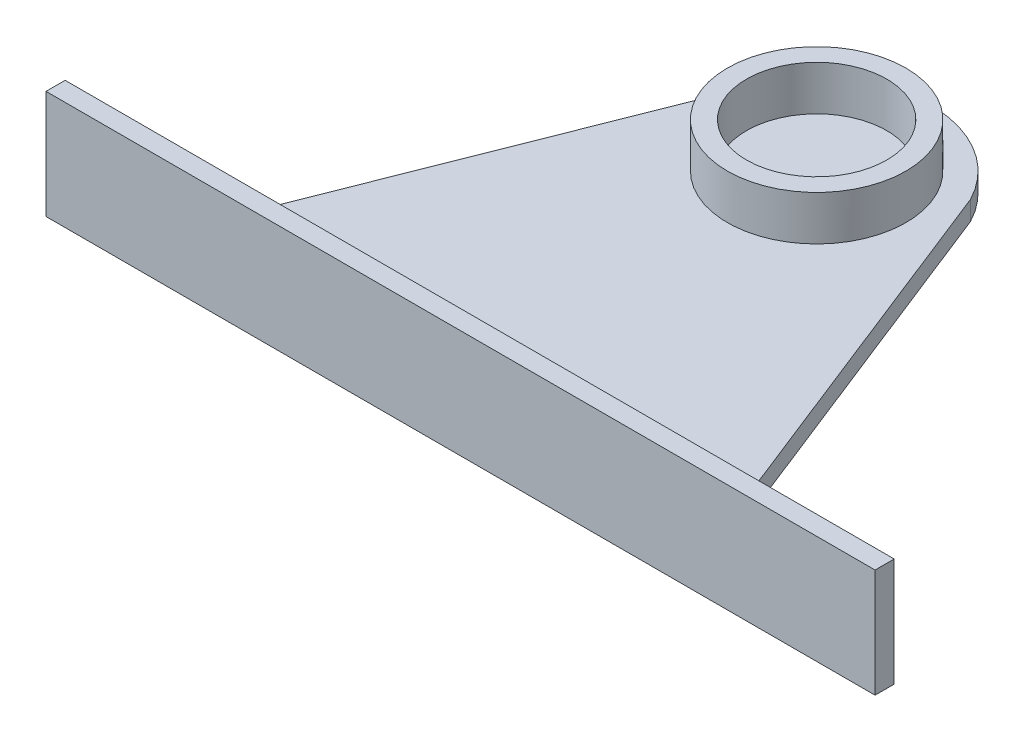
ISO-10303-21;
HEADER;
FILE_DESCRIPTION(('STEP AP214'),'2;1');
FILE_NAME('part.step','',(''),(''),'','','');
FILE_SCHEMA(('AUTOMOTIVE_DESIGN { 1 0 10303 214 1 1 1 1 }'));
ENDSEC;
DATA;
#1=APPLICATION_CONTEXT('core data for automotive mechanical design processes');
#2=APPLICATION_PROTOCOL_DEFINITION('international standard','automotive_design',2000,#1);
#3=PRODUCT_CONTEXT('',#1,'mechanical');
#4=PRODUCT('Part','Part','',(#3));
#5=PRODUCT_RELATED_PRODUCT_CATEGORY('part','',(#4));
#6=PRODUCT_DEFINITION_FORMATION('','',#4);
#7=PRODUCT_DEFINITION_CONTEXT('part definition',#1,'design');
#8=PRODUCT_DEFINITION('design','',#6,#7);
#9=PRODUCT_DEFINITION_SHAPE('','',#8);
#10=(LENGTH_UNIT() NAMED_UNIT(*) SI_UNIT(.MILLI.,.METRE.));
#11=(NAMED_UNIT(*) PLANE_ANGLE_UNIT() SI_UNIT($,.RADIAN.));
#12=(NAMED_UNIT(*) SI_UNIT($,.STERADIAN.) SOLID_ANGLE_UNIT());
#13=UNCERTAINTY_MEASURE_WITH_UNIT(LENGTH_MEASURE(1.E-05),#10,'distance_accuracy_value','');
#14=(GEOMETRIC_REPRESENTATION_CONTEXT(3) GLOBAL_UNCERTAINTY_ASSIGNED_CONTEXT((#13)) GLOBAL_UNIT_ASSIGNED_CONTEXT((#10,
#11,#12)) REPRESENTATION_CONTEXT('',''));
#15=CARTESIAN_POINT('',(0.,0.,0.));
#16=DIRECTION('',(0.,0.,1.));
#17=DIRECTION('',(1.,0.,0.));
#18=AXIS2_PLACEMENT_3D('',#15,#16,#17);
#19=CARTESIAN_POINT('',(-8.92914445149548,3.,-35.0049377267636));
#20=DIRECTION('',(0.,-1.,0.));
#21=DIRECTION('',(0.,0.,-1.));
#22=AXIS2_PLACEMENT_3D('',#19,#20,#21);
#23=PLANE('',#22);
#24=DIRECTION('',(-0.367083952716123,0.,0.930187815260073));
#25=VECTOR('',#24,1.);
#26=CARTESIAN_POINT('',(-24.8438078736417,3.,-43.196988965688));
#27=LINE('',#26,#25);
#28=CARTESIAN_POINT('',(-24.8438078736417,3.,-43.196988965688));
#29=VERTEX_POINT('',#28);
#30=CARTESIAN_POINT('',(-48.9291444514955,3.,17.8350622732364));
#31=VERTEX_POINT('',#30);
#32=EDGE_CURVE('E78',#29,#31,#27,.T.);
#33=ORIENTED_EDGE('',*,*,#32,.T.);
#34=DIRECTION('',(1.,0.,0.));
#35=VECTOR('',#34,1.);
#36=CARTESIAN_POINT('',(-48.9291444514955,3.,17.8350622732364));
#37=LINE('',#36,#35);
#38=CARTESIAN_POINT('',(31.0708555485045,3.,17.8350622732364));
#39=VERTEX_POINT('',#38);
#40=EDGE_CURVE('E149',#31,#39,#37,.T.);
#41=ORIENTED_EDGE('',*,*,#40,.T.);
#42=DIRECTION('',(-0.367083952716123,0.,-0.930187815260073));
#43=VECTOR('',#42,1.);
#44=CARTESIAN_POINT('',(31.0708555485045,3.,17.8350622732364));
#45=LINE('',#44,#43);
#46=CARTESIAN_POINT('',(6.98551897065071,3.,-43.196988965688));
#47=VERTEX_POINT('',#46);
#48=EDGE_CURVE('E151',#39,#47,#45,.T.);
#49=ORIENTED_EDGE('',*,*,#48,.T.);
#50=CARTESIAN_POINT('',(-8.92914445149548,3.,-35.0049377267636));
#51=DIRECTION('',(0.,1.,0.));
#52=DIRECTION('',(0.,0.,-1.));
#53=AXIS2_PLACEMENT_3D('',#50,#51,#52);
#54=CIRCLE('',#53,17.8993356117304);
#55=EDGE_CURVE('E52',#47,#29,#54,.T.);
#56=ORIENTED_EDGE('',*,*,#55,.T.);
#57=EDGE_LOOP('',(#33,#41,#49,#56));
#58=FACE_BOUND('',#57,.T.);
#59=CARTESIAN_POINT('',(-8.92914445149548,3.,-35.0049377267636));
#60=DIRECTION('',(0.,-1.,0.));
#61=DIRECTION('',(0.,0.,-1.));
#62=AXIS2_PLACEMENT_3D('',#59,#60,#61);
#63=CIRCLE('',#62,14.);
#64=CARTESIAN_POINT('',(-8.92914445149548,3.,-49.0049377267636));
#65=VERTEX_POINT('',#64);
#66=EDGE_CURVE('E11',#65,#65,#63,.F.);
#67=ORIENTED_EDGE('',*,*,#66,.F.);
#68=EDGE_LOOP('',(#67));
#69=FACE_BOUND('',#68,.T.);
#70=ADVANCED_FACE('F35',(#58,#69),#23,.F.);
#71=CARTESIAN_POINT('',(-24.8438078736417,3.,-43.196988965688));
#72=DIRECTION('',(0.930187815260072,0.,0.367083952716123));
#73=DIRECTION('',(0.367083952716123,0.,-0.930187815260073));
#74=AXIS2_PLACEMENT_3D('',#71,#72,#73);
#75=PLANE('',#74);
#76=DIRECTION('',(-0.367083952716123,0.,0.930187815260073));
#77=VECTOR('',#76,1.);
#78=CARTESIAN_POINT('',(-24.8438078736417,0.,-43.196988965688));
#79=LINE('',#78,#77);
#80=CARTESIAN_POINT('',(-24.8438078736417,0.,-43.196988965688));
#81=VERTEX_POINT('',#80);
#82=CARTESIAN_POINT('',(-48.9291444514955,0.,17.8350622732364));
#83=VERTEX_POINT('',#82);
#84=EDGE_CURVE('E147',#81,#83,#79,.T.);
#85=ORIENTED_EDGE('',*,*,#84,.T.);
#86=DIRECTION('',(0.,-1.,0.));
#87=VECTOR('',#86,1.);
#88=CARTESIAN_POINT('',(-48.9291444514955,3.,17.8350622732364));
#89=LINE('',#88,#87);
#90=EDGE_CURVE('E44',#31,#83,#89,.T.);
#91=ORIENTED_EDGE('',*,*,#90,.F.);
#92=ORIENTED_EDGE('',*,*,#32,.F.);
#93=DIRECTION('',(0.,-1.,0.));
#94=VECTOR('',#93,1.);
#95=CARTESIAN_POINT('',(-24.8438078736417,3.,-43.196988965688));
#96=LINE('',#95,#94);
#97=EDGE_CURVE('E154',#29,#81,#96,.T.);
#98=ORIENTED_EDGE('',*,*,#97,.T.);
#99=EDGE_LOOP('',(#85,#91,#92,#98));
#100=FACE_BOUND('',#99,.T.);
#101=ADVANCED_FACE('F37',(#100),#75,.F.);
#102=CARTESIAN_POINT('',(31.0708555485045,3.,17.8350622732364));
#103=DIRECTION('',(-0.930187815260072,0.,0.367083952716123));
#104=DIRECTION('',(0.367083952716123,0.,0.930187815260073));
#105=AXIS2_PLACEMENT_3D('',#102,#103,#104);
#106=PLANE('',#105);
#107=DIRECTION('',(-0.367083952716123,0.,-0.930187815260073));
#108=VECTOR('',#107,1.);
#109=CARTESIAN_POINT('',(31.0708555485045,0.,17.8350622732364));
#110=LINE('',#109,#108);
#111=CARTESIAN_POINT('',(31.0708555485045,0.,17.8350622732364));
#112=VERTEX_POINT('',#111);
#113=CARTESIAN_POINT('',(6.98551897065071,0.,-43.196988965688));
#114=VERTEX_POINT('',#113);
#115=EDGE_CURVE('E67',#112,#114,#110,.T.);
#116=ORIENTED_EDGE('',*,*,#115,.T.);
#117=DIRECTION('',(0.,-1.,0.));
#118=VECTOR('',#117,1.);
#119=CARTESIAN_POINT('',(6.98551897065071,3.,-43.196988965688));
#120=LINE('',#119,#118);
#121=EDGE_CURVE('E163',#47,#114,#120,.T.);
#122=ORIENTED_EDGE('',*,*,#121,.F.);
#123=ORIENTED_EDGE('',*,*,#48,.F.);
#124=DIRECTION('',(0.,-1.,0.));
#125=VECTOR('',#124,1.);
#126=CARTESIAN_POINT('',(31.0708555485045,3.,17.8350622732364));
#127=LINE('',#126,#125);
#128=EDGE_CURVE('E165',#39,#112,#127,.T.);
#129=ORIENTED_EDGE('',*,*,#128,.T.);
#130=EDGE_LOOP('',(#116,#122,#123,#129));
#131=FACE_BOUND('',#130,.T.);
#132=ADVANCED_FACE('F176',(#131),#106,.F.);
#133=CARTESIAN_POINT('',(-8.92914445149548,3.,-35.0049377267636));
#134=DIRECTION('',(0.,-1.,0.));
#135=DIRECTION('',(0.,0.,-1.));
#136=AXIS2_PLACEMENT_3D('',#133,#134,#135);
#137=CYLINDRICAL_SURFACE('',#136,17.8993356117304);
#138=CARTESIAN_POINT('',(-8.92914445149548,0.,-35.0049377267636));
#139=DIRECTION('',(0.,1.,0.));
#140=DIRECTION('',(0.,0.,-1.));
#141=AXIS2_PLACEMENT_3D('',#138,#139,#140);
#142=CIRCLE('',#141,17.8993356117304);
#143=EDGE_CURVE('E73',#114,#81,#142,.T.);
#144=ORIENTED_EDGE('',*,*,#143,.T.);
#145=ORIENTED_EDGE('',*,*,#97,.F.);
#146=ORIENTED_EDGE('',*,*,#55,.F.);
#147=ORIENTED_EDGE('',*,*,#121,.T.);
#148=EDGE_LOOP('',(#144,#145,#146,#147));
#149=FACE_BOUND('',#148,.T.);
#150=ADVANCED_FACE('F203',(#149),#137,.T.);
#151=CARTESIAN_POINT('',(-8.92914445149548,0.,-35.0049377267636));
#152=DIRECTION('',(0.,-1.,0.));
#153=DIRECTION('',(0.,0.,-1.));
#154=AXIS2_PLACEMENT_3D('',#151,#152,#153);
#155=PLANE('',#154);
#156=ORIENTED_EDGE('',*,*,#84,.F.);
#157=ORIENTED_EDGE('',*,*,#143,.F.);
#158=ORIENTED_EDGE('',*,*,#115,.F.);
#159=DIRECTION('',(1.,0.,0.));
#160=VECTOR('',#159,1.);
#161=CARTESIAN_POINT('',(-48.9291444514955,0.,17.8350622732364));
#162=LINE('',#161,#160);
#163=EDGE_CURVE('E157',#83,#112,#162,.T.);
#164=ORIENTED_EDGE('',*,*,#163,.F.);
#165=EDGE_LOOP('',(#156,#157,#158,#164));
#166=FACE_BOUND('',#165,.T.);
#167=ADVANCED_FACE('F174',(#166),#155,.T.);
#168=CARTESIAN_POINT('',(-8.92914445149548,10.,-35.0049377267636));
#169=DIRECTION('',(0.,1.,0.));
#170=DIRECTION('',(0.,0.,1.));
#171=AXIS2_PLACEMENT_3D('',#168,#169,#170);
#172=PLANE('',#171);
#173=CARTESIAN_POINT('',(-8.92914445149548,10.,-35.0049377267636));
#174=DIRECTION('',(0.,1.,0.));
#175=DIRECTION('',(0.,0.,1.));
#176=AXIS2_PLACEMENT_3D('',#173,#174,#175);
#177=CIRCLE('',#176,14.);
#178=CARTESIAN_POINT('',(-8.92914445149548,10.,-21.0049377267636));
#179=VERTEX_POINT('',#178);
#180=EDGE_CURVE('E143',#179,#179,#177,.T.);
#181=ORIENTED_EDGE('',*,*,#180,.T.);
#182=EDGE_LOOP('',(#181));
#183=FACE_BOUND('',#182,.T.);
#184=CARTESIAN_POINT('',(-8.92914445149548,10.,-35.0049377267636));
#185=DIRECTION('',(0.,1.,0.));
#186=DIRECTION('',(0.,0.,1.));
#187=AXIS2_PLACEMENT_3D('',#184,#185,#186);
#188=CIRCLE('',#187,11.);
#189=CARTESIAN_POINT('',(-8.92914445149548,10.,-24.0049377267636));
#190=VERTEX_POINT('',#189);
#191=EDGE_CURVE('E136',#190,#190,#188,.T.);
#192=ORIENTED_EDGE('',*,*,#191,.F.);
#193=EDGE_LOOP('',(#192));
#194=FACE_BOUND('',#193,.T.);
#195=ADVANCED_FACE('F186',(#183,#194),#172,.T.);
#196=CARTESIAN_POINT('',(-8.92914445149548,10.,-35.0049377267636));
#197=DIRECTION('',(0.,-1.,0.));
#198=DIRECTION('',(0.,0.,-1.));
#199=AXIS2_PLACEMENT_3D('',#196,#197,#198);
#200=CYLINDRICAL_SURFACE('',#199,14.);
#201=ORIENTED_EDGE('',*,*,#180,.F.);
#202=EDGE_LOOP('',(#201));
#203=FACE_BOUND('',#202,.T.);
#204=ORIENTED_EDGE('',*,*,#66,.T.);
#205=EDGE_LOOP('',(#204));
#206=FACE_BOUND('',#205,.T.);
#207=ADVANCED_FACE('F183',(#203,#206),#200,.T.);
#208=CARTESIAN_POINT('',(-8.92914445149548,10.,-35.0049377267636));
#209=DIRECTION('',(0.,-1.,0.));
#210=DIRECTION('',(0.,0.,-1.));
#211=AXIS2_PLACEMENT_3D('',#208,#209,#210);
#212=CYLINDRICAL_SURFACE('',#211,11.);
#213=ORIENTED_EDGE('',*,*,#191,.T.);
#214=EDGE_LOOP('',(#213));
#215=FACE_BOUND('',#214,.T.);
#216=CARTESIAN_POINT('',(-8.92914445149548,3.,-35.0049377267636));
#217=DIRECTION('',(0.,1.,0.));
#218=DIRECTION('',(0.,0.,1.));
#219=AXIS2_PLACEMENT_3D('',#216,#217,#218);
#220=CIRCLE('',#219,11.);
#221=CARTESIAN_POINT('',(-8.92914445149548,3.,-24.0049377267636));
#222=VERTEX_POINT('',#221);
#223=EDGE_CURVE('E133',#222,#222,#220,.T.);
#224=ORIENTED_EDGE('',*,*,#223,.F.);
#225=EDGE_LOOP('',(#224));
#226=FACE_BOUND('',#225,.T.);
#227=ADVANCED_FACE('F185',(#215,#226),#212,.F.);
#228=ORIENTED_EDGE('',*,*,#223,.T.);
#229=EDGE_LOOP('',(#228));
#230=FACE_BOUND('',#229,.T.);
#231=ADVANCED_FACE('F180',(#230),#23,.F.);
#232=CARTESIAN_POINT('',(0.,0.,17.8350622732364));
#233=DIRECTION('',(0.,0.,-1.));
#234=DIRECTION('',(-1.,0.,0.));
#235=AXIS2_PLACEMENT_3D('',#232,#233,#234);
#236=PLANE('',#235);
#237=DIRECTION('',(0.,-1.,0.));
#238=VECTOR('',#237,1.);
#239=CARTESIAN_POINT('',(-73.9291444514955,-7.7494968496404,17.8350622732364));
#240=LINE('',#239,#238);
#241=CARTESIAN_POINT('',(-73.9291444514955,9.2505031503596,17.8350622732364));
#242=VERTEX_POINT('',#241);
#243=CARTESIAN_POINT('',(-73.9291444514955,-7.7494968496404,17.8350622732364));
#244=VERTEX_POINT('',#243);
#245=EDGE_CURVE('E132',#242,#244,#240,.T.);
#246=ORIENTED_EDGE('',*,*,#245,.F.);
#247=DIRECTION('',(-1.,0.,0.));
#248=VECTOR('',#247,1.);
#249=CARTESIAN_POINT('',(-73.9291444514955,9.2505031503596,17.8350622732364));
#250=LINE('',#249,#248);
#251=CARTESIAN_POINT('',(56.0708555485045,9.2505031503596,17.8350622732364));
#252=VERTEX_POINT('',#251);
#253=EDGE_CURVE('E128',#252,#242,#250,.T.);
#254=ORIENTED_EDGE('',*,*,#253,.F.);
#255=DIRECTION('',(0.,1.,0.));
#256=VECTOR('',#255,1.);
#257=CARTESIAN_POINT('',(56.0708555485045,-7.7494968496404,17.8350622732364));
#258=LINE('',#257,#256);
#259=CARTESIAN_POINT('',(56.0708555485045,-7.7494968496404,17.8350622732364));
#260=VERTEX_POINT('',#259);
#261=EDGE_CURVE('E311',#260,#252,#258,.T.);
#262=ORIENTED_EDGE('',*,*,#261,.F.);
#263=DIRECTION('',(1.,0.,0.));
#264=VECTOR('',#263,1.);
#265=CARTESIAN_POINT('',(-73.9291444514955,-7.7494968496404,17.8350622732364));
#266=LINE('',#265,#264);
#267=EDGE_CURVE('E314',#244,#260,#266,.T.);
#268=ORIENTED_EDGE('',*,*,#267,.F.);
#269=EDGE_LOOP('',(#246,#254,#262,#268));
#270=FACE_BOUND('',#269,.T.);
#271=ORIENTED_EDGE('',*,*,#40,.F.);
#272=ORIENTED_EDGE('',*,*,#90,.T.);
#273=ORIENTED_EDGE('',*,*,#163,.T.);
#274=ORIENTED_EDGE('',*,*,#128,.F.);
#275=EDGE_LOOP('',(#271,#272,#273,#274));
#276=FACE_BOUND('',#275,.T.);
#277=ADVANCED_FACE('F169',(#270,#276),#236,.T.);
#278=CARTESIAN_POINT('',(-73.9291444514955,-7.7494968496404,20.8350622732364));
#279=DIRECTION('',(1.,0.,0.));
#280=DIRECTION('',(0.,0.,-1.));
#281=AXIS2_PLACEMENT_3D('',#278,#279,#280);
#282=PLANE('',#281);
#283=ORIENTED_EDGE('',*,*,#245,.T.);
#284=DIRECTION('',(0.,0.,-1.));
#285=VECTOR('',#284,1.);
#286=CARTESIAN_POINT('',(-73.9291444514955,-7.7494968496404,20.8350622732364));
#287=LINE('',#286,#285);
#288=CARTESIAN_POINT('',(-73.9291444514955,-7.7494968496404,20.8350622732364));
#289=VERTEX_POINT('',#288);
#290=EDGE_CURVE('E112',#289,#244,#287,.T.);
#291=ORIENTED_EDGE('',*,*,#290,.F.);
#292=DIRECTION('',(0.,-1.,0.));
#293=VECTOR('',#292,1.);
#294=CARTESIAN_POINT('',(-73.9291444514955,-7.7494968496404,20.8350622732364));
#295=LINE('',#294,#293);
#296=CARTESIAN_POINT('',(-73.9291444514955,9.2505031503596,20.8350622732364));
#297=VERTEX_POINT('',#296);
#298=EDGE_CURVE('E119',#297,#289,#295,.T.);
#299=ORIENTED_EDGE('',*,*,#298,.F.);
#300=DIRECTION('',(0.,0.,-1.));
#301=VECTOR('',#300,1.);
#302=CARTESIAN_POINT('',(-73.9291444514955,9.2505031503596,20.8350622732364));
#303=LINE('',#302,#301);
#304=EDGE_CURVE('E308',#297,#242,#303,.T.);
#305=ORIENTED_EDGE('',*,*,#304,.T.);
#306=EDGE_LOOP('',(#283,#291,#299,#305));
#307=FACE_BOUND('',#306,.T.);
#308=ADVANCED_FACE('F130',(#307),#282,.F.);
#309=CARTESIAN_POINT('',(-73.9291444514955,-7.7494968496404,20.8350622732364));
#310=DIRECTION('',(0.,1.,0.));
#311=DIRECTION('',(0.,0.,1.));
#312=AXIS2_PLACEMENT_3D('',#309,#310,#311);
#313=PLANE('',#312);
#314=ORIENTED_EDGE('',*,*,#267,.T.);
#315=DIRECTION('',(0.,0.,-1.));
#316=VECTOR('',#315,1.);
#317=CARTESIAN_POINT('',(56.0708555485045,-7.7494968496404,20.8350622732364));
#318=LINE('',#317,#316);
#319=CARTESIAN_POINT('',(56.0708555485045,-7.7494968496404,20.8350622732364));
#320=VERTEX_POINT('',#319);
#321=EDGE_CURVE('E115',#320,#260,#318,.T.);
#322=ORIENTED_EDGE('',*,*,#321,.F.);
#323=DIRECTION('',(1.,0.,0.));
#324=VECTOR('',#323,1.);
#325=CARTESIAN_POINT('',(-73.9291444514955,-7.7494968496404,20.8350622732364));
#326=LINE('',#325,#324);
#327=EDGE_CURVE('E108',#289,#320,#326,.T.);
#328=ORIENTED_EDGE('',*,*,#327,.F.);
#329=ORIENTED_EDGE('',*,*,#290,.T.);
#330=EDGE_LOOP('',(#314,#322,#328,#329));
#331=FACE_BOUND('',#330,.T.);
#332=ADVANCED_FACE('F110',(#331),#313,.F.);
#333=CARTESIAN_POINT('',(56.0708555485045,-7.7494968496404,20.8350622732364));
#334=DIRECTION('',(-1.,0.,0.));
#335=DIRECTION('',(0.,0.,1.));
#336=AXIS2_PLACEMENT_3D('',#333,#334,#335);
#337=PLANE('',#336);
#338=ORIENTED_EDGE('',*,*,#261,.T.);
#339=DIRECTION('',(0.,0.,-1.));
#340=VECTOR('',#339,1.);
#341=CARTESIAN_POINT('',(56.0708555485045,9.2505031503596,20.8350622732364));
#342=LINE('',#341,#340);
#343=CARTESIAN_POINT('',(56.0708555485045,9.2505031503596,20.8350622732364));
#344=VERTEX_POINT('',#343);
#345=EDGE_CURVE('E138',#344,#252,#342,.T.);
#346=ORIENTED_EDGE('',*,*,#345,.F.);
#347=DIRECTION('',(0.,1.,0.));
#348=VECTOR('',#347,1.);
#349=CARTESIAN_POINT('',(56.0708555485045,-7.7494968496404,20.8350622732364));
#350=LINE('',#349,#348);
#351=EDGE_CURVE('E118',#320,#344,#350,.T.);
#352=ORIENTED_EDGE('',*,*,#351,.F.);
#353=ORIENTED_EDGE('',*,*,#321,.T.);
#354=EDGE_LOOP('',(#338,#346,#352,#353));
#355=FACE_BOUND('',#354,.T.);
#356=ADVANCED_FACE('F275',(#355),#337,.F.);
#357=CARTESIAN_POINT('',(-73.9291444514955,9.2505031503596,20.8350622732364));
#358=DIRECTION('',(0.,-1.,0.));
#359=DIRECTION('',(0.,0.,-1.));
#360=AXIS2_PLACEMENT_3D('',#357,#358,#359);
#361=PLANE('',#360);
#362=ORIENTED_EDGE('',*,*,#253,.T.);
#363=ORIENTED_EDGE('',*,*,#304,.F.);
#364=DIRECTION('',(-1.,0.,0.));
#365=VECTOR('',#364,1.);
#366=CARTESIAN_POINT('',(-73.9291444514955,9.2505031503596,20.8350622732364));
#367=LINE('',#366,#365);
#368=EDGE_CURVE('E124',#344,#297,#367,.T.);
#369=ORIENTED_EDGE('',*,*,#368,.F.);
#370=ORIENTED_EDGE('',*,*,#345,.T.);
#371=EDGE_LOOP('',(#362,#363,#369,#370));
#372=FACE_BOUND('',#371,.T.);
#373=ADVANCED_FACE('F284',(#372),#361,.F.);
#374=CARTESIAN_POINT('',(0.,0.,20.8350622732364));
#375=DIRECTION('',(0.,0.,-1.));
#376=DIRECTION('',(-1.,0.,0.));
#377=AXIS2_PLACEMENT_3D('',#374,#375,#376);
#378=PLANE('',#377);
#379=ORIENTED_EDGE('',*,*,#298,.T.);
#380=ORIENTED_EDGE('',*,*,#327,.T.);
#381=ORIENTED_EDGE('',*,*,#351,.T.);
#382=ORIENTED_EDGE('',*,*,#368,.T.);
#383=EDGE_LOOP('',(#379,#380,#381,#382));
#384=FACE_BOUND('',#383,.T.);
#385=ADVANCED_FACE('F122',(#384),#378,.F.);
#386=CLOSED_SHELL('',(#70,#101,#132,#150,#167,#195,#207,#227,#231,#277,#308,#332,#356,#373,#385));
#387=MANIFOLD_SOLID_BREP('B2',#386);
#388=ADVANCED_BREP_SHAPE_REPRESENTATION('',(#18,#387),#14);
#389=SHAPE_DEFINITION_REPRESENTATION(#9,#388);
ENDSEC;
END-ISO-10303-21;
